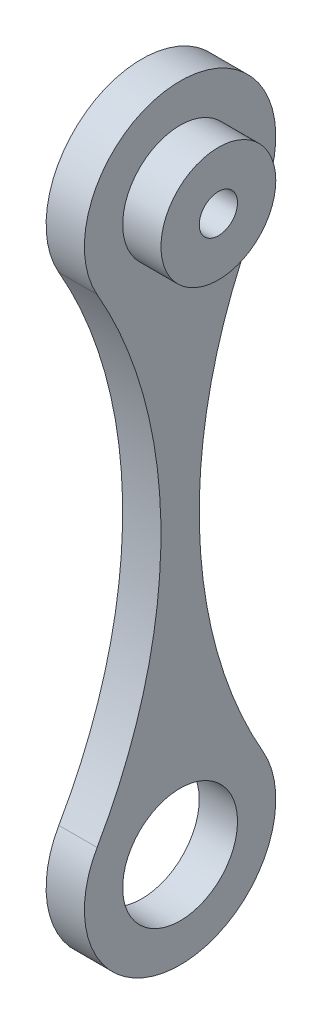
ISO-10303-21;
HEADER;
FILE_DESCRIPTION(('STEP AP214'),'2;1');
FILE_NAME('part.step','',(''),(''),'','','');
FILE_SCHEMA(('AUTOMOTIVE_DESIGN { 1 0 10303 214 1 1 1 1 }'));
ENDSEC;
DATA;
#1=APPLICATION_CONTEXT('core data for automotive mechanical design processes');
#2=APPLICATION_PROTOCOL_DEFINITION('international standard','automotive_design',2000,#1);
#3=PRODUCT_CONTEXT('',#1,'mechanical');
#4=PRODUCT('Part','Part','',(#3));
#5=PRODUCT_RELATED_PRODUCT_CATEGORY('part','',(#4));
#6=PRODUCT_DEFINITION_FORMATION('','',#4);
#7=PRODUCT_DEFINITION_CONTEXT('part definition',#1,'design');
#8=PRODUCT_DEFINITION('design','',#6,#7);
#9=PRODUCT_DEFINITION_SHAPE('','',#8);
#10=(LENGTH_UNIT() NAMED_UNIT(*) SI_UNIT(.MILLI.,.METRE.));
#11=(NAMED_UNIT(*) PLANE_ANGLE_UNIT() SI_UNIT($,.RADIAN.));
#12=(NAMED_UNIT(*) SI_UNIT($,.STERADIAN.) SOLID_ANGLE_UNIT());
#13=UNCERTAINTY_MEASURE_WITH_UNIT(LENGTH_MEASURE(1.E-05),#10,'distance_accuracy_value','');
#14=(GEOMETRIC_REPRESENTATION_CONTEXT(3) GLOBAL_UNCERTAINTY_ASSIGNED_CONTEXT((#13)) GLOBAL_UNIT_ASSIGNED_CONTEXT((#10,
#11,#12)) REPRESENTATION_CONTEXT('',''));
#15=CARTESIAN_POINT('',(0.,0.,0.));
#16=DIRECTION('',(0.,0.,1.));
#17=DIRECTION('',(1.,0.,0.));
#18=AXIS2_PLACEMENT_3D('',#15,#16,#17);
#19=CARTESIAN_POINT('',(10.,-150.,0.));
#20=DIRECTION('',(-1.,0.,0.));
#21=DIRECTION('',(0.,0.,1.));
#22=AXIS2_PLACEMENT_3D('',#19,#20,#21);
#23=CYLINDRICAL_SURFACE('',#22,15.);
#24=CARTESIAN_POINT('',(10.,-150.,0.));
#25=DIRECTION('',(1.,0.,0.));
#26=DIRECTION('',(0.,0.,-1.));
#27=AXIS2_PLACEMENT_3D('',#24,#25,#26);
#28=CIRCLE('',#27,15.);
#29=CARTESIAN_POINT('',(10.,-150.,-15.));
#30=VERTEX_POINT('',#29);
#31=EDGE_CURVE('E117',#30,#30,#28,.T.);
#32=ORIENTED_EDGE('',*,*,#31,.T.);
#33=EDGE_LOOP('',(#32));
#34=FACE_BOUND('',#33,.T.);
#35=CARTESIAN_POINT('',(0.,-150.,0.));
#36=DIRECTION('',(1.,0.,0.));
#37=DIRECTION('',(0.,0.,-1.));
#38=AXIS2_PLACEMENT_3D('',#35,#36,#37);
#39=CIRCLE('',#38,15.);
#40=CARTESIAN_POINT('',(0.,-150.,-15.));
#41=VERTEX_POINT('',#40);
#42=EDGE_CURVE('E112',#41,#41,#39,.T.);
#43=ORIENTED_EDGE('',*,*,#42,.F.);
#44=EDGE_LOOP('',(#43));
#45=FACE_BOUND('',#44,.T.);
#46=ADVANCED_FACE('F51',(#34,#45),#23,.F.);
#47=CARTESIAN_POINT('',(10.,-75.,-130.625));
#48=DIRECTION('',(-1.,0.,0.));
#49=DIRECTION('',(0.,0.,1.));
#50=AXIS2_PLACEMENT_3D('',#47,#48,#49);
#51=CYLINDRICAL_SURFACE('',#50,125.625);
#52=CARTESIAN_POINT('',(0.,-75.,-130.625));
#53=DIRECTION('',(1.,0.,0.));
#54=DIRECTION('',(0.,0.,-1.));
#55=AXIS2_PLACEMENT_3D('',#52,#53,#54);
#56=CIRCLE('',#55,125.625);
#57=CARTESIAN_POINT('',(0.,-12.448132780083,-21.6804979253112));
#58=VERTEX_POINT('',#57);
#59=CARTESIAN_POINT('',(0.,-137.551867219917,-21.6804979253112));
#60=VERTEX_POINT('',#59);
#61=EDGE_CURVE('E104',#58,#60,#56,.T.);
#62=ORIENTED_EDGE('',*,*,#61,.F.);
#63=DIRECTION('',(-1.,0.,0.));
#64=VECTOR('',#63,1.);
#65=CARTESIAN_POINT('',(10.,-12.448132780083,-21.6804979253112));
#66=LINE('',#65,#64);
#67=CARTESIAN_POINT('',(10.,-12.448132780083,-21.6804979253112));
#68=VERTEX_POINT('',#67);
#69=EDGE_CURVE('E60',#68,#58,#66,.T.);
#70=ORIENTED_EDGE('',*,*,#69,.F.);
#71=CARTESIAN_POINT('',(10.,-75.,-130.625));
#72=DIRECTION('',(1.,0.,0.));
#73=DIRECTION('',(0.,0.,-1.));
#74=AXIS2_PLACEMENT_3D('',#71,#72,#73);
#75=CIRCLE('',#74,125.625);
#76=CARTESIAN_POINT('',(10.,-137.551867219917,-21.6804979253112));
#77=VERTEX_POINT('',#76);
#78=EDGE_CURVE('E102',#68,#77,#75,.T.);
#79=ORIENTED_EDGE('',*,*,#78,.T.);
#80=DIRECTION('',(-1.,0.,0.));
#81=VECTOR('',#80,1.);
#82=CARTESIAN_POINT('',(10.,-137.551867219917,-21.6804979253112));
#83=LINE('',#82,#81);
#84=EDGE_CURVE('E12',#77,#60,#83,.T.);
#85=ORIENTED_EDGE('',*,*,#84,.T.);
#86=EDGE_LOOP('',(#62,#70,#79,#85));
#87=FACE_BOUND('',#86,.T.);
#88=ADVANCED_FACE('F101',(#87),#51,.F.);
#89=CARTESIAN_POINT('',(10.,0.,0.));
#90=DIRECTION('',(-1.,0.,0.));
#91=DIRECTION('',(0.,0.,1.));
#92=AXIS2_PLACEMENT_3D('',#89,#90,#91);
#93=CYLINDRICAL_SURFACE('',#92,25.);
#94=CARTESIAN_POINT('',(0.,0.,0.));
#95=DIRECTION('',(1.,0.,0.));
#96=DIRECTION('',(0.,0.,-1.));
#97=AXIS2_PLACEMENT_3D('',#94,#95,#96);
#98=CIRCLE('',#97,25.);
#99=CARTESIAN_POINT('',(0.,-12.448132780083,21.6804979253112));
#100=VERTEX_POINT('',#99);
#101=EDGE_CURVE('E83',#58,#100,#98,.T.);
#102=ORIENTED_EDGE('',*,*,#101,.T.);
#103=DIRECTION('',(-1.,0.,0.));
#104=VECTOR('',#103,1.);
#105=CARTESIAN_POINT('',(10.,-12.448132780083,21.6804979253112));
#106=LINE('',#105,#104);
#107=CARTESIAN_POINT('',(10.,-12.448132780083,21.6804979253112));
#108=VERTEX_POINT('',#107);
#109=EDGE_CURVE('E105',#108,#100,#106,.T.);
#110=ORIENTED_EDGE('',*,*,#109,.F.);
#111=CARTESIAN_POINT('',(10.,0.,0.));
#112=DIRECTION('',(1.,0.,0.));
#113=DIRECTION('',(0.,0.,-1.));
#114=AXIS2_PLACEMENT_3D('',#111,#112,#113);
#115=CIRCLE('',#114,25.);
#116=EDGE_CURVE('E106',#68,#108,#115,.T.);
#117=ORIENTED_EDGE('',*,*,#116,.F.);
#118=ORIENTED_EDGE('',*,*,#69,.T.);
#119=EDGE_LOOP('',(#102,#110,#117,#118));
#120=FACE_BOUND('',#119,.T.);
#121=ADVANCED_FACE('F107',(#120),#93,.T.);
#122=CARTESIAN_POINT('',(10.,-75.,130.625));
#123=DIRECTION('',(-1.,0.,0.));
#124=DIRECTION('',(0.,0.,1.));
#125=AXIS2_PLACEMENT_3D('',#122,#123,#124);
#126=CYLINDRICAL_SURFACE('',#125,125.625);
#127=CARTESIAN_POINT('',(0.,-75.,130.625));
#128=DIRECTION('',(1.,0.,0.));
#129=DIRECTION('',(0.,0.,-1.));
#130=AXIS2_PLACEMENT_3D('',#127,#128,#129);
#131=CIRCLE('',#130,125.625);
#132=CARTESIAN_POINT('',(0.,-137.551867219917,21.6804979253112));
#133=VERTEX_POINT('',#132);
#134=EDGE_CURVE('E89',#100,#133,#131,.F.);
#135=ORIENTED_EDGE('',*,*,#134,.T.);
#136=DIRECTION('',(-1.,0.,0.));
#137=VECTOR('',#136,1.);
#138=CARTESIAN_POINT('',(10.,-137.551867219917,21.6804979253112));
#139=LINE('',#138,#137);
#140=CARTESIAN_POINT('',(10.,-137.551867219917,21.6804979253112));
#141=VERTEX_POINT('',#140);
#142=EDGE_CURVE('E120',#141,#133,#139,.T.);
#143=ORIENTED_EDGE('',*,*,#142,.F.);
#144=CARTESIAN_POINT('',(10.,-75.,130.625));
#145=DIRECTION('',(1.,0.,0.));
#146=DIRECTION('',(0.,0.,-1.));
#147=AXIS2_PLACEMENT_3D('',#144,#145,#146);
#148=CIRCLE('',#147,125.625);
#149=EDGE_CURVE('E68',#108,#141,#148,.F.);
#150=ORIENTED_EDGE('',*,*,#149,.F.);
#151=ORIENTED_EDGE('',*,*,#109,.T.);
#152=EDGE_LOOP('',(#135,#143,#150,#151));
#153=FACE_BOUND('',#152,.T.);
#154=ADVANCED_FACE('F131',(#153),#126,.F.);
#155=CARTESIAN_POINT('',(10.,-150.,0.));
#156=DIRECTION('',(-1.,0.,0.));
#157=DIRECTION('',(0.,0.,1.));
#158=AXIS2_PLACEMENT_3D('',#155,#156,#157);
#159=CYLINDRICAL_SURFACE('',#158,25.);
#160=CARTESIAN_POINT('',(0.,-150.,0.));
#161=DIRECTION('',(1.,0.,0.));
#162=DIRECTION('',(0.,0.,-1.));
#163=AXIS2_PLACEMENT_3D('',#160,#161,#162);
#164=CIRCLE('',#163,25.);
#165=EDGE_CURVE('E121',#133,#60,#164,.T.);
#166=ORIENTED_EDGE('',*,*,#165,.T.);
#167=ORIENTED_EDGE('',*,*,#84,.F.);
#168=CARTESIAN_POINT('',(10.,-150.,0.));
#169=DIRECTION('',(1.,0.,0.));
#170=DIRECTION('',(0.,0.,-1.));
#171=AXIS2_PLACEMENT_3D('',#168,#169,#170);
#172=CIRCLE('',#171,25.);
#173=EDGE_CURVE('E94',#141,#77,#172,.T.);
#174=ORIENTED_EDGE('',*,*,#173,.F.);
#175=ORIENTED_EDGE('',*,*,#142,.T.);
#176=EDGE_LOOP('',(#166,#167,#174,#175));
#177=FACE_BOUND('',#176,.T.);
#178=ADVANCED_FACE('F53',(#177),#159,.T.);
#179=CARTESIAN_POINT('',(0.,0.,0.));
#180=DIRECTION('',(1.,0.,0.));
#181=DIRECTION('',(0.,0.,-1.));
#182=AXIS2_PLACEMENT_3D('',#179,#180,#181);
#183=PLANE('',#182);
#184=CARTESIAN_POINT('',(0.,0.,0.));
#185=DIRECTION('',(1.,0.,0.));
#186=DIRECTION('',(0.,0.,-1.));
#187=AXIS2_PLACEMENT_3D('',#184,#185,#186);
#188=CIRCLE('',#187,5.);
#189=CARTESIAN_POINT('',(0.,0.,-5.));
#190=VERTEX_POINT('',#189);
#191=EDGE_CURVE('E225',#190,#190,#188,.T.);
#192=ORIENTED_EDGE('',*,*,#191,.T.);
#193=EDGE_LOOP('',(#192));
#194=FACE_BOUND('',#193,.T.);
#195=ORIENTED_EDGE('',*,*,#165,.F.);
#196=ORIENTED_EDGE('',*,*,#134,.F.);
#197=ORIENTED_EDGE('',*,*,#101,.F.);
#198=ORIENTED_EDGE('',*,*,#61,.T.);
#199=EDGE_LOOP('',(#195,#196,#197,#198));
#200=FACE_BOUND('',#199,.T.);
#201=ORIENTED_EDGE('',*,*,#42,.T.);
#202=EDGE_LOOP('',(#201));
#203=FACE_BOUND('',#202,.T.);
#204=ADVANCED_FACE('F134',(#194,#200,#203),#183,.F.);
#205=CARTESIAN_POINT('',(10.,0.,0.));
#206=DIRECTION('',(1.,0.,0.));
#207=DIRECTION('',(0.,0.,-1.));
#208=AXIS2_PLACEMENT_3D('',#205,#206,#207);
#209=PLANE('',#208);
#210=CARTESIAN_POINT('',(10.,0.,0.));
#211=DIRECTION('',(1.,0.,0.));
#212=DIRECTION('',(0.,0.,-1.));
#213=AXIS2_PLACEMENT_3D('',#210,#211,#212);
#214=CIRCLE('',#213,15.);
#215=CARTESIAN_POINT('',(10.,0.,-15.));
#216=VERTEX_POINT('',#215);
#217=EDGE_CURVE('E226',#216,#216,#214,.T.);
#218=ORIENTED_EDGE('',*,*,#217,.F.);
#219=EDGE_LOOP('',(#218));
#220=FACE_BOUND('',#219,.T.);
#221=ORIENTED_EDGE('',*,*,#173,.T.);
#222=ORIENTED_EDGE('',*,*,#78,.F.);
#223=ORIENTED_EDGE('',*,*,#116,.T.);
#224=ORIENTED_EDGE('',*,*,#149,.T.);
#225=EDGE_LOOP('',(#221,#222,#223,#224));
#226=FACE_BOUND('',#225,.T.);
#227=ORIENTED_EDGE('',*,*,#31,.F.);
#228=EDGE_LOOP('',(#227));
#229=FACE_BOUND('',#228,.T.);
#230=ADVANCED_FACE('F109',(#220,#226,#229),#209,.T.);
#231=CARTESIAN_POINT('',(20.,0.,0.));
#232=DIRECTION('',(-1.,0.,0.));
#233=DIRECTION('',(0.,0.,1.));
#234=AXIS2_PLACEMENT_3D('',#231,#232,#233);
#235=CYLINDRICAL_SURFACE('',#234,15.);
#236=CARTESIAN_POINT('',(20.,0.,0.));
#237=DIRECTION('',(1.,0.,0.));
#238=DIRECTION('',(0.,0.,-1.));
#239=AXIS2_PLACEMENT_3D('',#236,#237,#238);
#240=CIRCLE('',#239,15.);
#241=CARTESIAN_POINT('',(20.,0.,-15.));
#242=VERTEX_POINT('',#241);
#243=EDGE_CURVE('E124',#242,#242,#240,.T.);
#244=ORIENTED_EDGE('',*,*,#243,.F.);
#245=EDGE_LOOP('',(#244));
#246=FACE_BOUND('',#245,.T.);
#247=ORIENTED_EDGE('',*,*,#217,.T.);
#248=EDGE_LOOP('',(#247));
#249=FACE_BOUND('',#248,.T.);
#250=ADVANCED_FACE('F177',(#246,#249),#235,.T.);
#251=CARTESIAN_POINT('',(20.,0.,0.));
#252=DIRECTION('',(1.,0.,0.));
#253=DIRECTION('',(0.,0.,-1.));
#254=AXIS2_PLACEMENT_3D('',#251,#252,#253);
#255=PLANE('',#254);
#256=CARTESIAN_POINT('',(20.,0.,0.));
#257=DIRECTION('',(1.,0.,0.));
#258=DIRECTION('',(0.,0.,-1.));
#259=AXIS2_PLACEMENT_3D('',#256,#257,#258);
#260=CIRCLE('',#259,5.);
#261=CARTESIAN_POINT('',(20.,0.,-5.));
#262=VERTEX_POINT('',#261);
#263=EDGE_CURVE('E222',#262,#262,#260,.T.);
#264=ORIENTED_EDGE('',*,*,#263,.F.);
#265=EDGE_LOOP('',(#264));
#266=FACE_BOUND('',#265,.T.);
#267=ORIENTED_EDGE('',*,*,#243,.T.);
#268=EDGE_LOOP('',(#267));
#269=FACE_BOUND('',#268,.T.);
#270=ADVANCED_FACE('F187',(#266,#269),#255,.T.);
#271=CARTESIAN_POINT('',(-25.,0.,0.));
#272=DIRECTION('',(1.,0.,0.));
#273=DIRECTION('',(0.,0.,-1.));
#274=AXIS2_PLACEMENT_3D('',#271,#272,#273);
#275=CYLINDRICAL_SURFACE('',#274,5.);
#276=ORIENTED_EDGE('',*,*,#263,.T.);
#277=EDGE_LOOP('',(#276));
#278=FACE_BOUND('',#277,.T.);
#279=ORIENTED_EDGE('',*,*,#191,.F.);
#280=EDGE_LOOP('',(#279));
#281=FACE_BOUND('',#280,.T.);
#282=ADVANCED_FACE('F205',(#278,#281),#275,.F.);
#283=CLOSED_SHELL('',(#46,#88,#121,#154,#178,#204,#230,#250,#270,#282));
#284=MANIFOLD_SOLID_BREP('B2',#283);
#285=ADVANCED_BREP_SHAPE_REPRESENTATION('',(#18,#284),#14);
#286=SHAPE_DEFINITION_REPRESENTATION(#9,#285);
ENDSEC;
END-ISO-10303-21;
